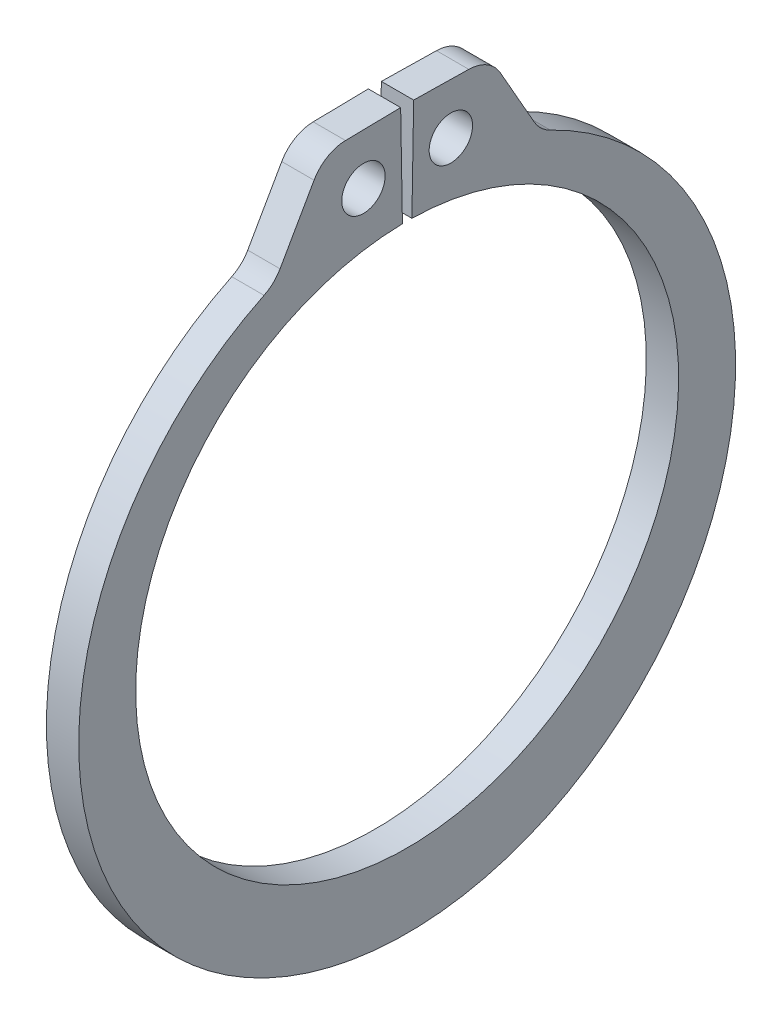
ISO-10303-21;
HEADER;
FILE_DESCRIPTION(('STEP AP214'),'2;1');
FILE_NAME('part.step','',(''),(''),'','','');
FILE_SCHEMA(('AUTOMOTIVE_DESIGN { 1 0 10303 214 1 1 1 1 }'));
ENDSEC;
DATA;
#1=APPLICATION_CONTEXT('core data for automotive mechanical design processes');
#2=APPLICATION_PROTOCOL_DEFINITION('international standard','automotive_design',2000,#1);
#3=PRODUCT_CONTEXT('',#1,'mechanical');
#4=PRODUCT('Part','Part','',(#3));
#5=PRODUCT_RELATED_PRODUCT_CATEGORY('part','',(#4));
#6=PRODUCT_DEFINITION_FORMATION('','',#4);
#7=PRODUCT_DEFINITION_CONTEXT('part definition',#1,'design');
#8=PRODUCT_DEFINITION('design','',#6,#7);
#9=PRODUCT_DEFINITION_SHAPE('','',#8);
#10=(LENGTH_UNIT() NAMED_UNIT(*) SI_UNIT(.MILLI.,.METRE.));
#11=(NAMED_UNIT(*) PLANE_ANGLE_UNIT() SI_UNIT($,.RADIAN.));
#12=(NAMED_UNIT(*) SI_UNIT($,.STERADIAN.) SOLID_ANGLE_UNIT());
#13=UNCERTAINTY_MEASURE_WITH_UNIT(LENGTH_MEASURE(1.E-05),#10,'distance_accuracy_value','');
#14=(GEOMETRIC_REPRESENTATION_CONTEXT(3) GLOBAL_UNCERTAINTY_ASSIGNED_CONTEXT((#13)) GLOBAL_UNIT_ASSIGNED_CONTEXT((#10,
#11,#12)) REPRESENTATION_CONTEXT('',''));
#15=CARTESIAN_POINT('',(0.,0.,0.));
#16=DIRECTION('',(0.,0.,1.));
#17=DIRECTION('',(1.,0.,0.));
#18=AXIS2_PLACEMENT_3D('',#15,#16,#17);
#19=CARTESIAN_POINT('',(0.4445,0.,0.));
#20=DIRECTION('',(1.,0.,0.));
#21=DIRECTION('',(0.,0.,-1.));
#22=AXIS2_PLACEMENT_3D('',#19,#20,#21);
#23=PLANE('',#22);
#24=CARTESIAN_POINT('',(0.4445,8.84496411963868,1.20229902470405));
#25=DIRECTION('',(1.,0.,0.));
#26=DIRECTION('',(0.,0.,-1.));
#27=AXIS2_PLACEMENT_3D('',#24,#25,#26);
#28=CIRCLE('',#27,0.5969);
#29=CARTESIAN_POINT('',(0.4445,8.84496411963868,0.605399024704051));
#30=VERTEX_POINT('',#29);
#31=EDGE_CURVE('E221',#30,#30,#28,.T.);
#32=ORIENTED_EDGE('',*,*,#31,.F.);
#33=EDGE_LOOP('',(#32));
#34=FACE_BOUND('',#33,.T.);
#35=DIRECTION('',(0.,-0.0174524064372829,0.999847695156391));
#36=VECTOR('',#35,1.);
#37=CARTESIAN_POINT('',(0.4445,10.2600371086168,0.179089613896828));
#38=LINE('',#37,#36);
#39=CARTESIAN_POINT('',(0.4445,10.2600371086168,0.179089613896828));
#40=VERTEX_POINT('',#39);
#41=CARTESIAN_POINT('',(0.4445,10.2335675066351,1.69553209581194));
#42=VERTEX_POINT('',#41);
#43=EDGE_CURVE('E133',#40,#42,#38,.T.);
#44=ORIENTED_EDGE('',*,*,#43,.T.);
#45=CARTESIAN_POINT('',(0.4445,9.21772224835619,1.67780045087166));
#46=DIRECTION('',(1.,0.,0.));
#47=DIRECTION('',(0.,0.,-1.));
#48=AXIS2_PLACEMENT_3D('',#45,#46,#47);
#49=CIRCLE('',#48,1.016);
#50=CARTESIAN_POINT('',(0.4445,9.7204720742893,2.56069263711199));
#51=VERTEX_POINT('',#50);
#52=EDGE_CURVE('E174',#42,#51,#49,.T.);
#53=ORIENTED_EDGE('',*,*,#52,.T.);
#54=DIRECTION('',(0.,-0.868988372283789,0.494832505839674));
#55=VECTOR('',#54,1.);
#56=CARTESIAN_POINT('',(0.4445,10.2234655909275,2.27427045909705));
#57=LINE('',#56,#55);
#58=CARTESIAN_POINT('',(0.4445,8.07779952045091,3.49608809465265));
#59=VERTEX_POINT('',#58);
#60=EDGE_CURVE('E213',#51,#59,#57,.T.);
#61=ORIENTED_EDGE('',*,*,#60,.T.);
#62=CARTESIAN_POINT('',(0.4445,8.58054934638402,4.37898028089298));
#63=DIRECTION('',(1.,0.,0.));
#64=DIRECTION('',(0.,0.,-1.));
#65=AXIS2_PLACEMENT_3D('',#62,#63,#64);
#66=CIRCLE('',#65,1.016);
#67=CARTESIAN_POINT('',(0.4445,7.66606225595336,3.93629601255304));
#68=VERTEX_POINT('',#67);
#69=EDGE_CURVE('E181',#59,#68,#66,.F.);
#70=ORIENTED_EDGE('',*,*,#69,.T.);
#71=CARTESIAN_POINT('',(0.4445,-0.465448495698567,0.));
#72=DIRECTION('',(1.,0.,0.));
#73=DIRECTION('',(0.,0.,-1.));
#74=AXIS2_PLACEMENT_3D('',#71,#72,#73);
#75=CIRCLE('',#74,9.03415150430143);
#76=CARTESIAN_POINT('',(0.4445,7.66606225595336,-3.93629601255304));
#77=VERTEX_POINT('',#76);
#78=EDGE_CURVE('E206',#68,#77,#75,.T.);
#79=ORIENTED_EDGE('',*,*,#78,.T.);
#80=CARTESIAN_POINT('',(0.4445,8.58054934638402,-4.37898028089298));
#81=DIRECTION('',(1.,0.,0.));
#82=DIRECTION('',(0.,0.,-1.));
#83=AXIS2_PLACEMENT_3D('',#80,#81,#82);
#84=CIRCLE('',#83,1.016);
#85=CARTESIAN_POINT('',(0.4445,8.07779952045091,-3.49608809465265));
#86=VERTEX_POINT('',#85);
#87=EDGE_CURVE('E11',#77,#86,#84,.F.);
#88=ORIENTED_EDGE('',*,*,#87,.T.);
#89=DIRECTION('',(0.,0.868988372283789,0.494832505839674));
#90=VECTOR('',#89,1.);
#91=CARTESIAN_POINT('',(0.4445,10.2234655909275,-2.27427045909705));
#92=LINE('',#91,#90);
#93=CARTESIAN_POINT('',(0.4445,9.7204720742893,-2.56069263711199));
#94=VERTEX_POINT('',#93);
#95=EDGE_CURVE('E205',#86,#94,#92,.T.);
#96=ORIENTED_EDGE('',*,*,#95,.T.);
#97=CARTESIAN_POINT('',(0.4445,9.21772224835619,-1.67780045087166));
#98=DIRECTION('',(1.,0.,0.));
#99=DIRECTION('',(0.,0.,-1.));
#100=AXIS2_PLACEMENT_3D('',#97,#98,#99);
#101=CIRCLE('',#100,1.016);
#102=CARTESIAN_POINT('',(0.4445,10.2335675066351,-1.69553209581194));
#103=VERTEX_POINT('',#102);
#104=EDGE_CURVE('E49',#94,#103,#101,.T.);
#105=ORIENTED_EDGE('',*,*,#104,.T.);
#106=DIRECTION('',(0.,0.0174524064372829,0.999847695156391));
#107=VECTOR('',#106,1.);
#108=CARTESIAN_POINT('',(0.4445,10.2600371086168,-0.179089613896828));
#109=LINE('',#108,#107);
#110=CARTESIAN_POINT('',(0.4445,10.2600371086168,-0.179089613896828));
#111=VERTEX_POINT('',#110);
#112=EDGE_CURVE('E210',#103,#111,#109,.T.);
#113=ORIENTED_EDGE('',*,*,#112,.T.);
#114=DIRECTION('',(0.,-0.999847695156391,0.0174524064372835));
#115=VECTOR('',#114,1.);
#116=CARTESIAN_POINT('',(0.4445,7.46646264834987,-0.130327590311058));
#117=LINE('',#116,#115);
#118=CARTESIAN_POINT('',(0.4445,7.46646264834987,-0.130327590311058));
#119=VERTEX_POINT('',#118);
#120=EDGE_CURVE('E139',#111,#119,#117,.T.);
#121=ORIENTED_EDGE('',*,*,#120,.T.);
#122=CARTESIAN_POINT('',(0.4445,0.,0.));
#123=DIRECTION('',(-1.,0.,0.));
#124=DIRECTION('',(0.,0.,-1.));
#125=AXIS2_PLACEMENT_3D('',#122,#123,#124);
#126=CIRCLE('',#125,7.4676);
#127=CARTESIAN_POINT('',(0.4445,7.46646264834987,0.130327590311058));
#128=VERTEX_POINT('',#127);
#129=EDGE_CURVE('E134',#119,#128,#126,.T.);
#130=ORIENTED_EDGE('',*,*,#129,.T.);
#131=DIRECTION('',(0.,0.999847695156391,0.0174524064372835));
#132=VECTOR('',#131,1.);
#133=CARTESIAN_POINT('',(0.4445,7.46646264834987,0.130327590311058));
#134=LINE('',#133,#132);
#135=EDGE_CURVE('E125',#128,#40,#134,.T.);
#136=ORIENTED_EDGE('',*,*,#135,.T.);
#137=EDGE_LOOP('',(#44,#53,#61,#70,#79,#88,#96,#105,#113,#121,#130,#136));
#138=FACE_BOUND('',#137,.T.);
#139=CARTESIAN_POINT('',(0.4445,8.84496411963868,-1.20229902470405));
#140=DIRECTION('',(1.,0.,0.));
#141=DIRECTION('',(0.,0.,-1.));
#142=AXIS2_PLACEMENT_3D('',#139,#140,#141);
#143=CIRCLE('',#142,0.5969);
#144=CARTESIAN_POINT('',(0.4445,8.84496411963868,-1.79919902470405));
#145=VERTEX_POINT('',#144);
#146=EDGE_CURVE('E247',#145,#145,#143,.T.);
#147=ORIENTED_EDGE('',*,*,#146,.F.);
#148=EDGE_LOOP('',(#147));
#149=FACE_BOUND('',#148,.T.);
#150=ADVANCED_FACE('F34',(#34,#138,#149),#23,.T.);
#151=CARTESIAN_POINT('',(-0.4445,0.,0.));
#152=DIRECTION('',(1.,0.,0.));
#153=DIRECTION('',(0.,0.,-1.));
#154=AXIS2_PLACEMENT_3D('',#151,#152,#153);
#155=PLANE('',#154);
#156=CARTESIAN_POINT('',(-0.4445,8.84496411963868,1.20229902470405));
#157=DIRECTION('',(1.,0.,0.));
#158=DIRECTION('',(0.,0.,-1.));
#159=AXIS2_PLACEMENT_3D('',#156,#157,#158);
#160=CIRCLE('',#159,0.5969);
#161=CARTESIAN_POINT('',(-0.4445,8.84496411963868,0.605399024704051));
#162=VERTEX_POINT('',#161);
#163=EDGE_CURVE('E244',#162,#162,#160,.T.);
#164=ORIENTED_EDGE('',*,*,#163,.T.);
#165=EDGE_LOOP('',(#164));
#166=FACE_BOUND('',#165,.T.);
#167=DIRECTION('',(0.,-0.868988372283789,0.494832505839674));
#168=VECTOR('',#167,1.);
#169=CARTESIAN_POINT('',(-0.4445,10.2234655909275,2.27427045909705));
#170=LINE('',#169,#168);
#171=CARTESIAN_POINT('',(-0.4445,9.7204720742893,2.56069263711199));
#172=VERTEX_POINT('',#171);
#173=CARTESIAN_POINT('',(-0.4445,8.07779952045091,3.49608809465265));
#174=VERTEX_POINT('',#173);
#175=EDGE_CURVE('E200',#172,#174,#170,.T.);
#176=ORIENTED_EDGE('',*,*,#175,.F.);
#177=CARTESIAN_POINT('',(-0.4445,9.21772224835619,1.67780045087166));
#178=DIRECTION('',(1.,0.,0.));
#179=DIRECTION('',(0.,0.,-1.));
#180=AXIS2_PLACEMENT_3D('',#177,#178,#179);
#181=CIRCLE('',#180,1.016);
#182=CARTESIAN_POINT('',(-0.4445,10.2335675066351,1.69553209581194));
#183=VERTEX_POINT('',#182);
#184=EDGE_CURVE('E170',#172,#183,#181,.F.);
#185=ORIENTED_EDGE('',*,*,#184,.T.);
#186=DIRECTION('',(0.,-0.0174524064372829,0.999847695156391));
#187=VECTOR('',#186,1.);
#188=CARTESIAN_POINT('',(-0.4445,10.2600371086168,0.179089613896828));
#189=LINE('',#188,#187);
#190=CARTESIAN_POINT('',(-0.4445,10.2600371086168,0.179089613896828));
#191=VERTEX_POINT('',#190);
#192=EDGE_CURVE('E223',#191,#183,#189,.T.);
#193=ORIENTED_EDGE('',*,*,#192,.F.);
#194=DIRECTION('',(0.,0.999847695156391,0.0174524064372835));
#195=VECTOR('',#194,1.);
#196=CARTESIAN_POINT('',(-0.4445,7.46646264834987,0.130327590311058));
#197=LINE('',#196,#195);
#198=CARTESIAN_POINT('',(-0.4445,7.46646264834987,0.130327590311058));
#199=VERTEX_POINT('',#198);
#200=EDGE_CURVE('E220',#199,#191,#197,.T.);
#201=ORIENTED_EDGE('',*,*,#200,.F.);
#202=CARTESIAN_POINT('',(-0.4445,0.,0.));
#203=DIRECTION('',(-1.,0.,0.));
#204=DIRECTION('',(0.,0.,-1.));
#205=AXIS2_PLACEMENT_3D('',#202,#203,#204);
#206=CIRCLE('',#205,7.4676);
#207=CARTESIAN_POINT('',(-0.4445,7.46646264834987,-0.130327590311058));
#208=VERTEX_POINT('',#207);
#209=EDGE_CURVE('E147',#208,#199,#206,.T.);
#210=ORIENTED_EDGE('',*,*,#209,.F.);
#211=DIRECTION('',(0.,-0.999847695156391,0.0174524064372835));
#212=VECTOR('',#211,1.);
#213=CARTESIAN_POINT('',(-0.4445,7.46646264834987,-0.130327590311058));
#214=LINE('',#213,#212);
#215=CARTESIAN_POINT('',(-0.4445,10.2600371086168,-0.179089613896828));
#216=VERTEX_POINT('',#215);
#217=EDGE_CURVE('E143',#216,#208,#214,.T.);
#218=ORIENTED_EDGE('',*,*,#217,.F.);
#219=DIRECTION('',(0.,0.0174524064372829,0.999847695156391));
#220=VECTOR('',#219,1.);
#221=CARTESIAN_POINT('',(-0.4445,10.2600371086168,-0.179089613896828));
#222=LINE('',#221,#220);
#223=CARTESIAN_POINT('',(-0.4445,10.2335675066351,-1.69553209581194));
#224=VERTEX_POINT('',#223);
#225=EDGE_CURVE('E228',#224,#216,#222,.T.);
#226=ORIENTED_EDGE('',*,*,#225,.F.);
#227=CARTESIAN_POINT('',(-0.4445,9.21772224835619,-1.67780045087166));
#228=DIRECTION('',(1.,0.,0.));
#229=DIRECTION('',(0.,0.,-1.));
#230=AXIS2_PLACEMENT_3D('',#227,#228,#229);
#231=CIRCLE('',#230,1.016);
#232=CARTESIAN_POINT('',(-0.4445,9.7204720742893,-2.56069263711199));
#233=VERTEX_POINT('',#232);
#234=EDGE_CURVE('E168',#224,#233,#231,.F.);
#235=ORIENTED_EDGE('',*,*,#234,.T.);
#236=DIRECTION('',(0.,0.868988372283789,0.494832505839674));
#237=VECTOR('',#236,1.);
#238=CARTESIAN_POINT('',(-0.4445,10.2234655909275,-2.27427045909705));
#239=LINE('',#238,#237);
#240=CARTESIAN_POINT('',(-0.4445,8.07779952045091,-3.49608809465265));
#241=VERTEX_POINT('',#240);
#242=EDGE_CURVE('E191',#241,#233,#239,.T.);
#243=ORIENTED_EDGE('',*,*,#242,.F.);
#244=CARTESIAN_POINT('',(-0.4445,8.58054934638402,-4.37898028089298));
#245=DIRECTION('',(1.,0.,0.));
#246=DIRECTION('',(0.,0.,-1.));
#247=AXIS2_PLACEMENT_3D('',#244,#245,#246);
#248=CIRCLE('',#247,1.016);
#249=CARTESIAN_POINT('',(-0.4445,7.66606225595336,-3.93629601255304));
#250=VERTEX_POINT('',#249);
#251=EDGE_CURVE('E42',#241,#250,#248,.T.);
#252=ORIENTED_EDGE('',*,*,#251,.T.);
#253=CARTESIAN_POINT('',(-0.4445,-0.465448495698567,0.));
#254=DIRECTION('',(1.,0.,0.));
#255=DIRECTION('',(0.,0.,-1.));
#256=AXIS2_PLACEMENT_3D('',#253,#254,#255);
#257=CIRCLE('',#256,9.03415150430143);
#258=CARTESIAN_POINT('',(-0.4445,7.66606225595336,3.93629601255304));
#259=VERTEX_POINT('',#258);
#260=EDGE_CURVE('E189',#259,#250,#257,.T.);
#261=ORIENTED_EDGE('',*,*,#260,.F.);
#262=CARTESIAN_POINT('',(-0.4445,8.58054934638402,4.37898028089298));
#263=DIRECTION('',(1.,0.,0.));
#264=DIRECTION('',(0.,0.,-1.));
#265=AXIS2_PLACEMENT_3D('',#262,#263,#264);
#266=CIRCLE('',#265,1.016);
#267=EDGE_CURVE('E179',#259,#174,#266,.T.);
#268=ORIENTED_EDGE('',*,*,#267,.T.);
#269=EDGE_LOOP('',(#176,#185,#193,#201,#210,#218,#226,#235,#243,#252,#261,#268));
#270=FACE_BOUND('',#269,.T.);
#271=CARTESIAN_POINT('',(-0.4445,8.84496411963868,-1.20229902470405));
#272=DIRECTION('',(1.,0.,0.));
#273=DIRECTION('',(0.,0.,-1.));
#274=AXIS2_PLACEMENT_3D('',#271,#272,#273);
#275=CIRCLE('',#274,0.5969);
#276=CARTESIAN_POINT('',(-0.4445,8.84496411963868,-1.79919902470405));
#277=VERTEX_POINT('',#276);
#278=EDGE_CURVE('E250',#277,#277,#275,.T.);
#279=ORIENTED_EDGE('',*,*,#278,.T.);
#280=EDGE_LOOP('',(#279));
#281=FACE_BOUND('',#280,.T.);
#282=ADVANCED_FACE('F187',(#166,#270,#281),#155,.F.);
#283=CARTESIAN_POINT('',(0.4445,0.,0.));
#284=DIRECTION('',(-1.,0.,0.));
#285=DIRECTION('',(0.,0.,1.));
#286=AXIS2_PLACEMENT_3D('',#283,#284,#285);
#287=CYLINDRICAL_SURFACE('',#286,7.4676);
#288=ORIENTED_EDGE('',*,*,#209,.T.);
#289=DIRECTION('',(-1.,0.,0.));
#290=VECTOR('',#289,1.);
#291=CARTESIAN_POINT('',(0.4445,7.46646264834987,0.130327590311058));
#292=LINE('',#291,#290);
#293=EDGE_CURVE('E129',#128,#199,#292,.T.);
#294=ORIENTED_EDGE('',*,*,#293,.F.);
#295=ORIENTED_EDGE('',*,*,#129,.F.);
#296=DIRECTION('',(-1.,0.,0.));
#297=VECTOR('',#296,1.);
#298=CARTESIAN_POINT('',(0.4445,7.46646264834987,-0.130327590311058));
#299=LINE('',#298,#297);
#300=EDGE_CURVE('E218',#119,#208,#299,.T.);
#301=ORIENTED_EDGE('',*,*,#300,.T.);
#302=EDGE_LOOP('',(#288,#294,#295,#301));
#303=FACE_BOUND('',#302,.T.);
#304=ADVANCED_FACE('F145',(#303),#287,.F.);
#305=CARTESIAN_POINT('',(0.4445,7.46646264834987,0.130327590311058));
#306=DIRECTION('',(0.,-0.0174524064372835,0.999847695156391));
#307=DIRECTION('',(0.,-0.999847695156391,-0.0174524064372835));
#308=AXIS2_PLACEMENT_3D('',#305,#306,#307);
#309=PLANE('',#308);
#310=ORIENTED_EDGE('',*,*,#200,.T.);
#311=DIRECTION('',(-1.,0.,0.));
#312=VECTOR('',#311,1.);
#313=CARTESIAN_POINT('',(0.4445,10.2600371086168,0.179089613896828));
#314=LINE('',#313,#312);
#315=EDGE_CURVE('E132',#40,#191,#314,.T.);
#316=ORIENTED_EDGE('',*,*,#315,.F.);
#317=ORIENTED_EDGE('',*,*,#135,.F.);
#318=ORIENTED_EDGE('',*,*,#293,.T.);
#319=EDGE_LOOP('',(#310,#316,#317,#318));
#320=FACE_BOUND('',#319,.T.);
#321=ADVANCED_FACE('F127',(#320),#309,.F.);
#322=CARTESIAN_POINT('',(0.4445,10.2600371086168,0.179089613896828));
#323=DIRECTION('',(0.,-0.999847695156391,-0.0174524064372829));
#324=DIRECTION('',(0.,0.0174524064372829,-0.999847695156391));
#325=AXIS2_PLACEMENT_3D('',#322,#323,#324);
#326=PLANE('',#325);
#327=ORIENTED_EDGE('',*,*,#192,.T.);
#328=DIRECTION('',(-1.,0.,0.));
#329=VECTOR('',#328,1.);
#330=CARTESIAN_POINT('',(0.4445,10.2335675066351,1.69553209581194));
#331=LINE('',#330,#329);
#332=EDGE_CURVE('E57',#183,#42,#331,.F.);
#333=ORIENTED_EDGE('',*,*,#332,.T.);
#334=ORIENTED_EDGE('',*,*,#43,.F.);
#335=ORIENTED_EDGE('',*,*,#315,.T.);
#336=EDGE_LOOP('',(#327,#333,#334,#335));
#337=FACE_BOUND('',#336,.T.);
#338=ADVANCED_FACE('F239',(#337),#326,.F.);
#339=CARTESIAN_POINT('',(0.4445,10.2234655909275,2.27427045909705));
#340=DIRECTION('',(0.,-0.494832505839674,-0.868988372283789));
#341=DIRECTION('',(0.,0.868988372283789,-0.494832505839674));
#342=AXIS2_PLACEMENT_3D('',#339,#340,#341);
#343=PLANE('',#342);
#344=ORIENTED_EDGE('',*,*,#175,.T.);
#345=DIRECTION('',(1.,0.,0.));
#346=VECTOR('',#345,1.);
#347=CARTESIAN_POINT('',(0.4445,8.07779952045091,3.49608809465265));
#348=LINE('',#347,#346);
#349=EDGE_CURVE('E161',#174,#59,#348,.T.);
#350=ORIENTED_EDGE('',*,*,#349,.T.);
#351=ORIENTED_EDGE('',*,*,#60,.F.);
#352=DIRECTION('',(-1.,0.,0.));
#353=VECTOR('',#352,1.);
#354=CARTESIAN_POINT('',(0.4445,9.7204720742893,2.56069263711199));
#355=LINE('',#354,#353);
#356=EDGE_CURVE('E158',#51,#172,#355,.T.);
#357=ORIENTED_EDGE('',*,*,#356,.T.);
#358=EDGE_LOOP('',(#344,#350,#351,#357));
#359=FACE_BOUND('',#358,.T.);
#360=ADVANCED_FACE('F280',(#359),#343,.F.);
#361=CARTESIAN_POINT('',(0.4445,-0.465448495698567,0.));
#362=DIRECTION('',(-1.,0.,0.));
#363=DIRECTION('',(0.,0.,1.));
#364=AXIS2_PLACEMENT_3D('',#361,#362,#363);
#365=CYLINDRICAL_SURFACE('',#364,9.03415150430143);
#366=ORIENTED_EDGE('',*,*,#78,.F.);
#367=DIRECTION('',(-1.,0.,0.));
#368=VECTOR('',#367,1.);
#369=CARTESIAN_POINT('',(0.4445,7.66606225595336,3.93629601255304));
#370=LINE('',#369,#368);
#371=EDGE_CURVE('E150',#68,#259,#370,.T.);
#372=ORIENTED_EDGE('',*,*,#371,.T.);
#373=ORIENTED_EDGE('',*,*,#260,.T.);
#374=DIRECTION('',(-1.,0.,0.));
#375=VECTOR('',#374,1.);
#376=CARTESIAN_POINT('',(0.4445,7.66606225595336,-3.93629601255304));
#377=LINE('',#376,#375);
#378=EDGE_CURVE('E148',#250,#77,#377,.F.);
#379=ORIENTED_EDGE('',*,*,#378,.T.);
#380=EDGE_LOOP('',(#366,#372,#373,#379));
#381=FACE_BOUND('',#380,.T.);
#382=ADVANCED_FACE('F197',(#381),#365,.T.);
#383=CARTESIAN_POINT('',(0.4445,10.2234655909275,-2.27427045909705));
#384=DIRECTION('',(0.,-0.494832505839674,0.868988372283789));
#385=DIRECTION('',(0.,-0.868988372283789,-0.494832505839674));
#386=AXIS2_PLACEMENT_3D('',#383,#384,#385);
#387=PLANE('',#386);
#388=ORIENTED_EDGE('',*,*,#95,.F.);
#389=DIRECTION('',(1.,0.,0.));
#390=VECTOR('',#389,1.);
#391=CARTESIAN_POINT('',(-0.4445,8.07779952045091,-3.49608809465265));
#392=LINE('',#391,#390);
#393=EDGE_CURVE('E165',#86,#241,#392,.F.);
#394=ORIENTED_EDGE('',*,*,#393,.T.);
#395=ORIENTED_EDGE('',*,*,#242,.T.);
#396=DIRECTION('',(-1.,0.,0.));
#397=VECTOR('',#396,1.);
#398=CARTESIAN_POINT('',(0.4445,9.7204720742893,-2.56069263711199));
#399=LINE('',#398,#397);
#400=EDGE_CURVE('E163',#233,#94,#399,.F.);
#401=ORIENTED_EDGE('',*,*,#400,.T.);
#402=EDGE_LOOP('',(#388,#394,#395,#401));
#403=FACE_BOUND('',#402,.T.);
#404=ADVANCED_FACE('F208',(#403),#387,.F.);
#405=CARTESIAN_POINT('',(0.4445,10.2600371086168,-0.179089613896828));
#406=DIRECTION('',(0.,-0.999847695156391,0.0174524064372829));
#407=DIRECTION('',(0.,-0.0174524064372829,-0.999847695156391));
#408=AXIS2_PLACEMENT_3D('',#405,#406,#407);
#409=PLANE('',#408);
#410=ORIENTED_EDGE('',*,*,#112,.F.);
#411=DIRECTION('',(-1.,0.,0.));
#412=VECTOR('',#411,1.);
#413=CARTESIAN_POINT('',(0.4445,10.2335675066351,-1.69553209581194));
#414=LINE('',#413,#412);
#415=EDGE_CURVE('E176',#103,#224,#414,.T.);
#416=ORIENTED_EDGE('',*,*,#415,.T.);
#417=ORIENTED_EDGE('',*,*,#225,.T.);
#418=DIRECTION('',(-1.,0.,0.));
#419=VECTOR('',#418,1.);
#420=CARTESIAN_POINT('',(0.4445,10.2600371086168,-0.179089613896828));
#421=LINE('',#420,#419);
#422=EDGE_CURVE('E152',#111,#216,#421,.T.);
#423=ORIENTED_EDGE('',*,*,#422,.F.);
#424=EDGE_LOOP('',(#410,#416,#417,#423));
#425=FACE_BOUND('',#424,.T.);
#426=ADVANCED_FACE('F273',(#425),#409,.F.);
#427=CARTESIAN_POINT('',(0.4445,7.46646264834987,-0.130327590311058));
#428=DIRECTION('',(0.,-0.0174524064372835,-0.999847695156391));
#429=DIRECTION('',(0.,0.999847695156391,-0.0174524064372835));
#430=AXIS2_PLACEMENT_3D('',#427,#428,#429);
#431=PLANE('',#430);
#432=ORIENTED_EDGE('',*,*,#217,.T.);
#433=ORIENTED_EDGE('',*,*,#300,.F.);
#434=ORIENTED_EDGE('',*,*,#120,.F.);
#435=ORIENTED_EDGE('',*,*,#422,.T.);
#436=EDGE_LOOP('',(#432,#433,#434,#435));
#437=FACE_BOUND('',#436,.T.);
#438=ADVANCED_FACE('F235',(#437),#431,.F.);
#439=CARTESIAN_POINT('',(0.4445,8.84496411963868,1.20229902470405));
#440=DIRECTION('',(-1.,0.,0.));
#441=DIRECTION('',(0.,0.,1.));
#442=AXIS2_PLACEMENT_3D('',#439,#440,#441);
#443=CYLINDRICAL_SURFACE('',#442,0.5969);
#444=ORIENTED_EDGE('',*,*,#31,.T.);
#445=EDGE_LOOP('',(#444));
#446=FACE_BOUND('',#445,.T.);
#447=ORIENTED_EDGE('',*,*,#163,.F.);
#448=EDGE_LOOP('',(#447));
#449=FACE_BOUND('',#448,.T.);
#450=ADVANCED_FACE('F268',(#446,#449),#443,.F.);
#451=CARTESIAN_POINT('',(0.4445,8.84496411963868,-1.20229902470405));
#452=DIRECTION('',(-1.,0.,0.));
#453=DIRECTION('',(0.,0.,1.));
#454=AXIS2_PLACEMENT_3D('',#451,#452,#453);
#455=CYLINDRICAL_SURFACE('',#454,0.5969);
#456=ORIENTED_EDGE('',*,*,#146,.T.);
#457=EDGE_LOOP('',(#456));
#458=FACE_BOUND('',#457,.T.);
#459=ORIENTED_EDGE('',*,*,#278,.F.);
#460=EDGE_LOOP('',(#459));
#461=FACE_BOUND('',#460,.T.);
#462=ADVANCED_FACE('F256',(#458,#461),#455,.F.);
#463=CARTESIAN_POINT('',(0.4445,8.58054934638402,4.37898028089298));
#464=DIRECTION('',(-1.,0.,0.));
#465=DIRECTION('',(0.,0.,1.));
#466=AXIS2_PLACEMENT_3D('',#463,#464,#465);
#467=CYLINDRICAL_SURFACE('',#466,1.016);
#468=ORIENTED_EDGE('',*,*,#69,.F.);
#469=ORIENTED_EDGE('',*,*,#349,.F.);
#470=ORIENTED_EDGE('',*,*,#267,.F.);
#471=ORIENTED_EDGE('',*,*,#371,.F.);
#472=EDGE_LOOP('',(#468,#469,#470,#471));
#473=FACE_BOUND('',#472,.T.);
#474=ADVANCED_FACE('F290',(#473),#467,.F.);
#475=CARTESIAN_POINT('',(0.4445,8.58054934638402,-4.37898028089298));
#476=DIRECTION('',(-1.,0.,0.));
#477=DIRECTION('',(0.,0.,1.));
#478=AXIS2_PLACEMENT_3D('',#475,#476,#477);
#479=CYLINDRICAL_SURFACE('',#478,1.016);
#480=ORIENTED_EDGE('',*,*,#87,.F.);
#481=ORIENTED_EDGE('',*,*,#378,.F.);
#482=ORIENTED_EDGE('',*,*,#251,.F.);
#483=ORIENTED_EDGE('',*,*,#393,.F.);
#484=EDGE_LOOP('',(#480,#481,#482,#483));
#485=FACE_BOUND('',#484,.T.);
#486=ADVANCED_FACE('F203',(#485),#479,.F.);
#487=CARTESIAN_POINT('',(0.4445,9.21772224835619,1.67780045087166));
#488=DIRECTION('',(-1.,0.,0.));
#489=DIRECTION('',(0.,0.,1.));
#490=AXIS2_PLACEMENT_3D('',#487,#488,#489);
#491=CYLINDRICAL_SURFACE('',#490,1.016);
#492=ORIENTED_EDGE('',*,*,#52,.F.);
#493=ORIENTED_EDGE('',*,*,#332,.F.);
#494=ORIENTED_EDGE('',*,*,#184,.F.);
#495=ORIENTED_EDGE('',*,*,#356,.F.);
#496=EDGE_LOOP('',(#492,#493,#494,#495));
#497=FACE_BOUND('',#496,.T.);
#498=ADVANCED_FACE('F295',(#497),#491,.T.);
#499=CARTESIAN_POINT('',(0.4445,9.21772224835619,-1.67780045087166));
#500=DIRECTION('',(-1.,0.,0.));
#501=DIRECTION('',(0.,0.,1.));
#502=AXIS2_PLACEMENT_3D('',#499,#500,#501);
#503=CYLINDRICAL_SURFACE('',#502,1.016);
#504=ORIENTED_EDGE('',*,*,#104,.F.);
#505=ORIENTED_EDGE('',*,*,#400,.F.);
#506=ORIENTED_EDGE('',*,*,#234,.F.);
#507=ORIENTED_EDGE('',*,*,#415,.F.);
#508=EDGE_LOOP('',(#504,#505,#506,#507));
#509=FACE_BOUND('',#508,.T.);
#510=ADVANCED_FACE('F36',(#509),#503,.T.);
#511=CLOSED_SHELL('',(#150,#282,#304,#321,#338,#360,#382,#404,#426,#438,#450,#462,#474,#486,
#498,#510));
#512=MANIFOLD_SOLID_BREP('B2',#511);
#513=ADVANCED_BREP_SHAPE_REPRESENTATION('',(#18,#512),#14);
#514=SHAPE_DEFINITION_REPRESENTATION(#9,#513);
ENDSEC;
END-ISO-10303-21;
